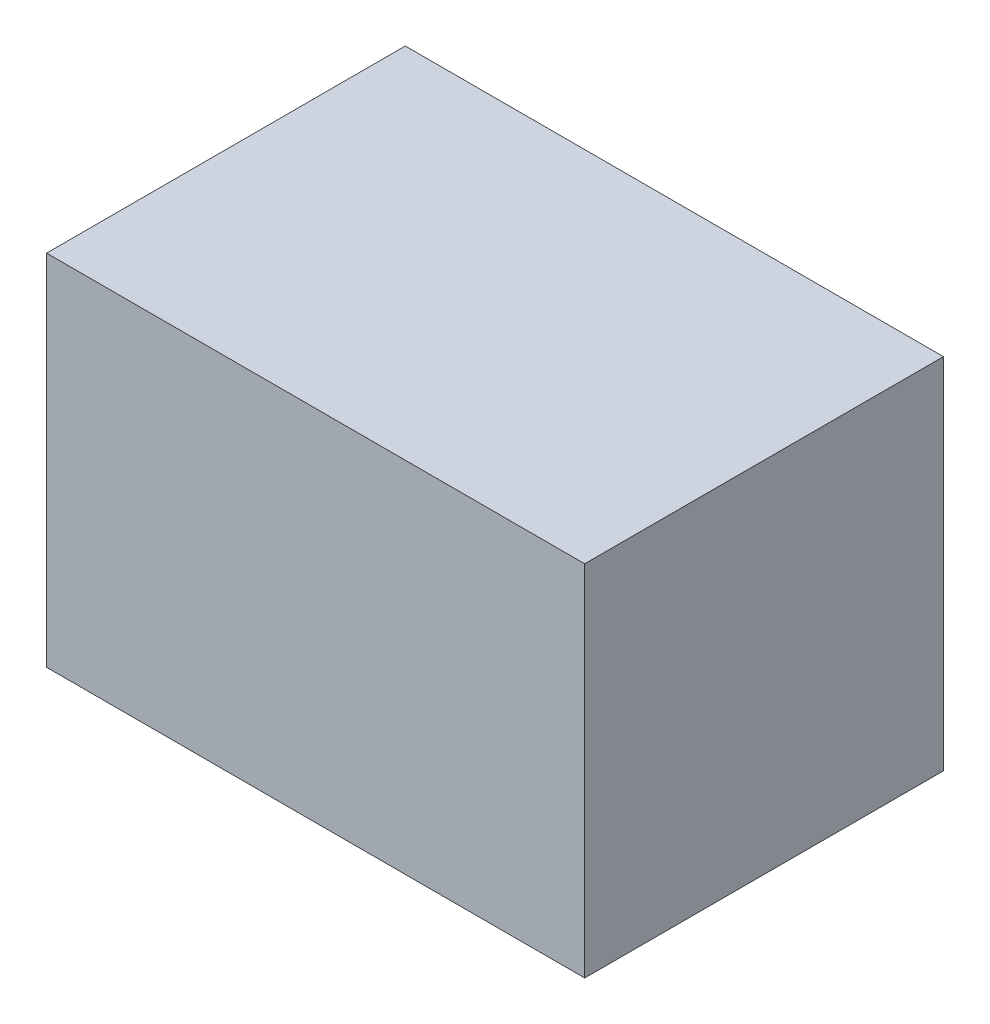
ISO-10303-21;
HEADER;
FILE_DESCRIPTION(('STEP AP214'),'2;1');
FILE_NAME('part.step','',(''),(''),'','','');
FILE_SCHEMA(('AUTOMOTIVE_DESIGN { 1 0 10303 214 1 1 1 1 }'));
ENDSEC;
DATA;
#1=APPLICATION_CONTEXT('core data for automotive mechanical design processes');
#2=APPLICATION_PROTOCOL_DEFINITION('international standard','automotive_design',2000,#1);
#3=PRODUCT_CONTEXT('',#1,'mechanical');
#4=PRODUCT('Part','Part','',(#3));
#5=PRODUCT_RELATED_PRODUCT_CATEGORY('part','',(#4));
#6=PRODUCT_DEFINITION_FORMATION('','',#4);
#7=PRODUCT_DEFINITION_CONTEXT('part definition',#1,'design');
#8=PRODUCT_DEFINITION('design','',#6,#7);
#9=PRODUCT_DEFINITION_SHAPE('','',#8);
#10=(LENGTH_UNIT() NAMED_UNIT(*) SI_UNIT(.MILLI.,.METRE.));
#11=(NAMED_UNIT(*) PLANE_ANGLE_UNIT() SI_UNIT($,.RADIAN.));
#12=(NAMED_UNIT(*) SI_UNIT($,.STERADIAN.) SOLID_ANGLE_UNIT());
#13=UNCERTAINTY_MEASURE_WITH_UNIT(LENGTH_MEASURE(1.E-05),#10,'distance_accuracy_value','');
#14=(GEOMETRIC_REPRESENTATION_CONTEXT(3) GLOBAL_UNCERTAINTY_ASSIGNED_CONTEXT((#13)) GLOBAL_UNIT_ASSIGNED_CONTEXT((#10,
#11,#12)) REPRESENTATION_CONTEXT('',''));
#15=CARTESIAN_POINT('',(0.,0.,0.));
#16=DIRECTION('',(0.,0.,1.));
#17=DIRECTION('',(1.,0.,0.));
#18=AXIS2_PLACEMENT_3D('',#15,#16,#17);
#19=CARTESIAN_POINT('',(0.1499997,0.09999980000001,0.));
#20=DIRECTION('',(0.,-1.,0.));
#21=DIRECTION('',(0.,0.,-1.));
#22=AXIS2_PLACEMENT_3D('',#19,#20,#21);
#23=PLANE('',#22);
#24=DIRECTION('',(0.,0.,-1.));
#25=VECTOR('',#24,1.);
#26=CARTESIAN_POINT('',(-0.1499997,0.09999980000001,0.));
#27=LINE('',#26,#25);
#28=CARTESIAN_POINT('',(-0.1499997,0.09999980000001,0.));
#29=VERTEX_POINT('',#28);
#30=CARTESIAN_POINT('',(-0.1499997,0.09999980000001,0.20000214));
#31=VERTEX_POINT('',#30);
#32=EDGE_CURVE('E20',#29,#31,#27,.F.);
#33=ORIENTED_EDGE('',*,*,#32,.T.);
#34=DIRECTION('',(-1.,0.,0.));
#35=VECTOR('',#34,1.);
#36=CARTESIAN_POINT('',(-0.1499997,0.09999980000001,0.20000214));
#37=LINE('',#36,#35);
#38=CARTESIAN_POINT('',(0.1499997,0.09999980000001,0.20000214));
#39=VERTEX_POINT('',#38);
#40=EDGE_CURVE('E55',#31,#39,#37,.F.);
#41=ORIENTED_EDGE('',*,*,#40,.T.);
#42=DIRECTION('',(0.,0.,1.));
#43=VECTOR('',#42,1.);
#44=CARTESIAN_POINT('',(0.1499997,0.09999980000001,0.));
#45=LINE('',#44,#43);
#46=CARTESIAN_POINT('',(0.1499997,0.09999980000001,0.));
#47=VERTEX_POINT('',#46);
#48=EDGE_CURVE('E76',#39,#47,#45,.F.);
#49=ORIENTED_EDGE('',*,*,#48,.T.);
#50=DIRECTION('',(-1.,0.,0.));
#51=VECTOR('',#50,1.);
#52=CARTESIAN_POINT('',(-0.1499997,0.09999980000001,0.));
#53=LINE('',#52,#51);
#54=EDGE_CURVE('E58',#29,#47,#53,.F.);
#55=ORIENTED_EDGE('',*,*,#54,.F.);
#56=EDGE_LOOP('',(#33,#41,#49,#55));
#57=FACE_BOUND('',#56,.T.);
#58=ADVANCED_FACE('F17',(#57),#23,.F.);
#59=CARTESIAN_POINT('',(-0.1499997,0.09999980000001,0.));
#60=DIRECTION('',(1.,0.,0.));
#61=DIRECTION('',(0.,0.,-1.));
#62=AXIS2_PLACEMENT_3D('',#59,#60,#61);
#63=PLANE('',#62);
#64=DIRECTION('',(0.,0.,1.));
#65=VECTOR('',#64,1.);
#66=CARTESIAN_POINT('',(-0.1499997,-0.09999725999998,0.));
#67=LINE('',#66,#65);
#68=CARTESIAN_POINT('',(-0.1499997,-0.09999725999998,0.));
#69=VERTEX_POINT('',#68);
#70=CARTESIAN_POINT('',(-0.1499997,-0.09999725999998,0.20000214));
#71=VERTEX_POINT('',#70);
#72=EDGE_CURVE('E73',#69,#71,#67,.T.);
#73=ORIENTED_EDGE('',*,*,#72,.T.);
#74=DIRECTION('',(0.,1.,0.));
#75=VECTOR('',#74,1.);
#76=CARTESIAN_POINT('',(-0.1499997,-0.09999725999998,0.20000214));
#77=LINE('',#76,#75);
#78=EDGE_CURVE('E63',#71,#31,#77,.T.);
#79=ORIENTED_EDGE('',*,*,#78,.T.);
#80=ORIENTED_EDGE('',*,*,#32,.F.);
#81=DIRECTION('',(0.,1.,0.));
#82=VECTOR('',#81,1.);
#83=CARTESIAN_POINT('',(-0.1499997,-0.09999725999998,0.));
#84=LINE('',#83,#82);
#85=EDGE_CURVE('E78',#69,#29,#84,.T.);
#86=ORIENTED_EDGE('',*,*,#85,.F.);
#87=EDGE_LOOP('',(#73,#79,#80,#86));
#88=FACE_BOUND('',#87,.T.);
#89=ADVANCED_FACE('F72',(#88),#63,.F.);
#90=CARTESIAN_POINT('',(-0.1499997,-0.09999725999998,0.20000214));
#91=DIRECTION('',(0.,0.,-1.));
#92=DIRECTION('',(-1.,0.,0.));
#93=AXIS2_PLACEMENT_3D('',#90,#91,#92);
#94=PLANE('',#93);
#95=DIRECTION('',(0.,1.,0.));
#96=VECTOR('',#95,1.);
#97=CARTESIAN_POINT('',(0.1499997,-0.09999725999998,0.20000214));
#98=LINE('',#97,#96);
#99=CARTESIAN_POINT('',(0.1499997,-0.09999725999998,0.20000214));
#100=VERTEX_POINT('',#99);
#101=EDGE_CURVE('E69',#100,#39,#98,.T.);
#102=ORIENTED_EDGE('',*,*,#101,.T.);
#103=ORIENTED_EDGE('',*,*,#40,.F.);
#104=ORIENTED_EDGE('',*,*,#78,.F.);
#105=DIRECTION('',(1.,0.,0.));
#106=VECTOR('',#105,1.);
#107=CARTESIAN_POINT('',(-0.1499997,-0.09999725999998,0.20000214));
#108=LINE('',#107,#106);
#109=EDGE_CURVE('E83',#71,#100,#108,.T.);
#110=ORIENTED_EDGE('',*,*,#109,.T.);
#111=EDGE_LOOP('',(#102,#103,#104,#110));
#112=FACE_BOUND('',#111,.T.);
#113=ADVANCED_FACE('F66',(#112),#94,.F.);
#114=CARTESIAN_POINT('',(0.1499997,-0.09999725999998,0.));
#115=DIRECTION('',(-1.,0.,0.));
#116=DIRECTION('',(0.,0.,1.));
#117=AXIS2_PLACEMENT_3D('',#114,#115,#116);
#118=PLANE('',#117);
#119=ORIENTED_EDGE('',*,*,#48,.F.);
#120=ORIENTED_EDGE('',*,*,#101,.F.);
#121=DIRECTION('',(0.,0.,1.));
#122=VECTOR('',#121,1.);
#123=CARTESIAN_POINT('',(0.1499997,-0.09999725999998,0.));
#124=LINE('',#123,#122);
#125=CARTESIAN_POINT('',(0.1499997,-0.09999725999998,0.));
#126=VERTEX_POINT('',#125);
#127=EDGE_CURVE('E26',#100,#126,#124,.F.);
#128=ORIENTED_EDGE('',*,*,#127,.T.);
#129=DIRECTION('',(0.,1.,0.));
#130=VECTOR('',#129,1.);
#131=CARTESIAN_POINT('',(0.1499997,-0.09999725999998,0.));
#132=LINE('',#131,#130);
#133=EDGE_CURVE('E34',#47,#126,#132,.F.);
#134=ORIENTED_EDGE('',*,*,#133,.F.);
#135=EDGE_LOOP('',(#119,#120,#128,#134));
#136=FACE_BOUND('',#135,.T.);
#137=ADVANCED_FACE('F88',(#136),#118,.F.);
#138=CARTESIAN_POINT('',(-0.1499997,-0.09999725999998,0.));
#139=DIRECTION('',(0.,0.,-1.));
#140=DIRECTION('',(-1.,0.,0.));
#141=AXIS2_PLACEMENT_3D('',#138,#139,#140);
#142=PLANE('',#141);
#143=ORIENTED_EDGE('',*,*,#133,.T.);
#144=DIRECTION('',(1.,0.,0.));
#145=VECTOR('',#144,1.);
#146=CARTESIAN_POINT('',(-0.1499997,-0.09999725999998,0.));
#147=LINE('',#146,#145);
#148=EDGE_CURVE('E11',#126,#69,#147,.F.);
#149=ORIENTED_EDGE('',*,*,#148,.T.);
#150=ORIENTED_EDGE('',*,*,#85,.T.);
#151=ORIENTED_EDGE('',*,*,#54,.T.);
#152=EDGE_LOOP('',(#143,#149,#150,#151));
#153=FACE_BOUND('',#152,.T.);
#154=ADVANCED_FACE('F91',(#153),#142,.T.);
#155=CARTESIAN_POINT('',(-0.1499997,-0.09999725999998,0.));
#156=DIRECTION('',(0.,1.,0.));
#157=DIRECTION('',(0.,0.,1.));
#158=AXIS2_PLACEMENT_3D('',#155,#156,#157);
#159=PLANE('',#158);
#160=ORIENTED_EDGE('',*,*,#127,.F.);
#161=ORIENTED_EDGE('',*,*,#109,.F.);
#162=ORIENTED_EDGE('',*,*,#72,.F.);
#163=ORIENTED_EDGE('',*,*,#148,.F.);
#164=EDGE_LOOP('',(#160,#161,#162,#163));
#165=FACE_BOUND('',#164,.T.);
#166=ADVANCED_FACE('F90',(#165),#159,.F.);
#167=CLOSED_SHELL('',(#58,#89,#113,#137,#154,#166));
#168=MANIFOLD_SOLID_BREP('B1',#167);
#169=ADVANCED_BREP_SHAPE_REPRESENTATION('',(#18,#168),#14);
#170=SHAPE_DEFINITION_REPRESENTATION(#9,#169);
ENDSEC;
END-ISO-10303-21;
